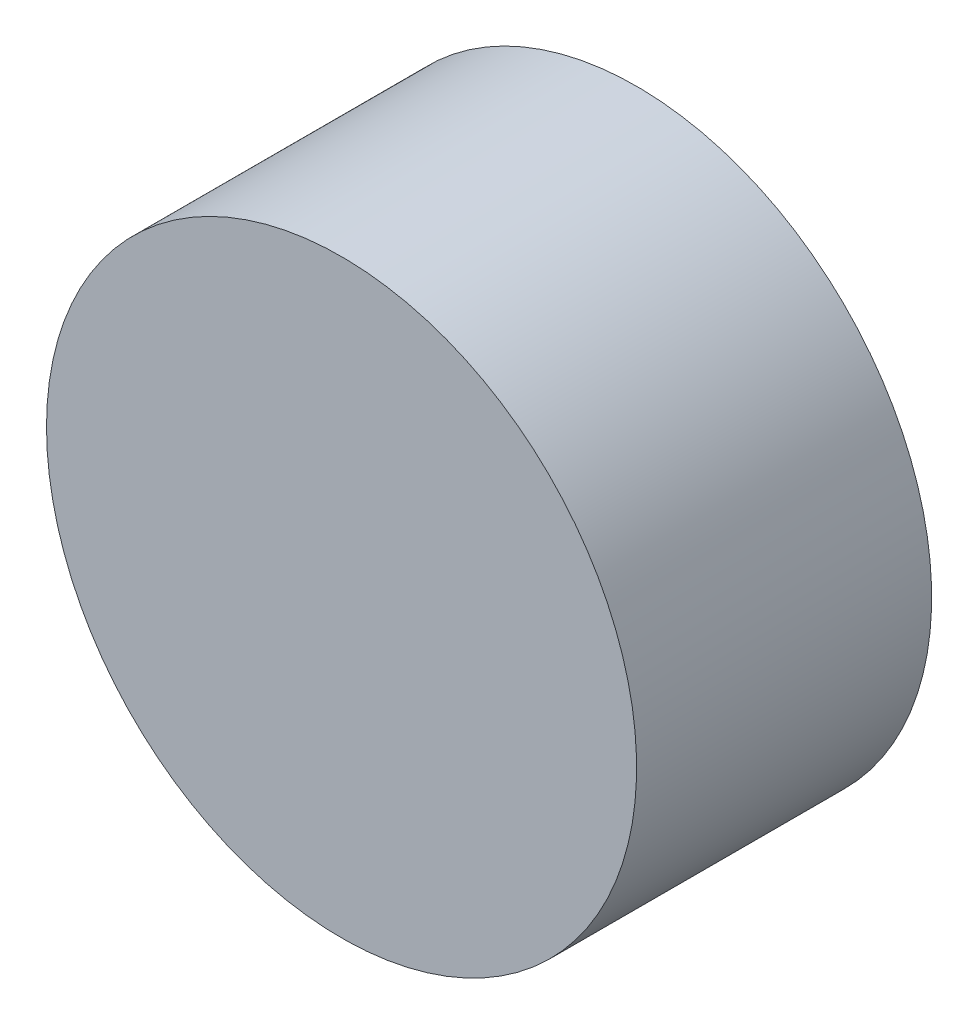
ISO-10303-21;
HEADER;
FILE_DESCRIPTION(('STEP AP214'),'2;1');
FILE_NAME('part.step','',(''),(''),'','','');
FILE_SCHEMA(('AUTOMOTIVE_DESIGN { 1 0 10303 214 1 1 1 1 }'));
ENDSEC;
DATA;
#1=APPLICATION_CONTEXT('core data for automotive mechanical design processes');
#2=APPLICATION_PROTOCOL_DEFINITION('international standard','automotive_design',2000,#1);
#3=PRODUCT_CONTEXT('',#1,'mechanical');
#4=PRODUCT('Part','Part','',(#3));
#5=PRODUCT_RELATED_PRODUCT_CATEGORY('part','',(#4));
#6=PRODUCT_DEFINITION_FORMATION('','',#4);
#7=PRODUCT_DEFINITION_CONTEXT('part definition',#1,'design');
#8=PRODUCT_DEFINITION('design','',#6,#7);
#9=PRODUCT_DEFINITION_SHAPE('','',#8);
#10=(LENGTH_UNIT() NAMED_UNIT(*) SI_UNIT(.MILLI.,.METRE.));
#11=(NAMED_UNIT(*) PLANE_ANGLE_UNIT() SI_UNIT($,.RADIAN.));
#12=(NAMED_UNIT(*) SI_UNIT($,.STERADIAN.) SOLID_ANGLE_UNIT());
#13=UNCERTAINTY_MEASURE_WITH_UNIT(LENGTH_MEASURE(1.E-05),#10,'distance_accuracy_value','');
#14=(GEOMETRIC_REPRESENTATION_CONTEXT(3) GLOBAL_UNCERTAINTY_ASSIGNED_CONTEXT((#13)) GLOBAL_UNIT_ASSIGNED_CONTEXT((#10,
#11,#12)) REPRESENTATION_CONTEXT('',''));
#15=CARTESIAN_POINT('',(0.,0.,0.));
#16=DIRECTION('',(0.,0.,1.));
#17=DIRECTION('',(1.,0.,0.));
#18=AXIS2_PLACEMENT_3D('',#15,#16,#17);
#19=CARTESIAN_POINT('',(0.,0.,25.4));
#20=DIRECTION('',(0.,0.,1.));
#21=DIRECTION('',(1.,0.,0.));
#22=AXIS2_PLACEMENT_3D('',#19,#20,#21);
#23=PLANE('',#22);
#24=CARTESIAN_POINT('',(0.,0.,25.4));
#25=DIRECTION('',(0.,0.,-1.));
#26=DIRECTION('',(-1.,0.,0.));
#27=AXIS2_PLACEMENT_3D('',#24,#25,#26);
#28=CIRCLE('',#27,25.4);
#29=CARTESIAN_POINT('',(-25.4,0.,25.4));
#30=VERTEX_POINT('',#29);
#31=EDGE_CURVE('E49',#30,#30,#28,.T.);
#32=ORIENTED_EDGE('',*,*,#31,.T.);
#33=EDGE_LOOP('',(#32));
#34=FACE_BOUND('',#33,.T.);
#35=ADVANCED_FACE('F35',(#34),#23,.F.);
#36=CARTESIAN_POINT('',(-28.575,0.,28.575));
#37=DIRECTION('',(0.,0.,-1.));
#38=DIRECTION('',(-1.,0.,0.));
#39=AXIS2_PLACEMENT_3D('',#36,#37,#38);
#40=PLANE('',#39);
#41=CARTESIAN_POINT('',(0.,0.,28.575));
#42=DIRECTION('',(0.,0.,-1.));
#43=DIRECTION('',(-1.,0.,0.));
#44=AXIS2_PLACEMENT_3D('',#41,#42,#43);
#45=CIRCLE('',#44,28.575);
#46=CARTESIAN_POINT('',(-28.575,0.,28.575));
#47=VERTEX_POINT('',#46);
#48=EDGE_CURVE('E10',#47,#47,#45,.T.);
#49=ORIENTED_EDGE('',*,*,#48,.F.);
#50=EDGE_LOOP('',(#49));
#51=FACE_BOUND('',#50,.T.);
#52=ADVANCED_FACE('F69',(#51),#40,.F.);
#53=CARTESIAN_POINT('',(0.,0.,0.));
#54=DIRECTION('',(0.,0.,-1.));
#55=DIRECTION('',(-1.,0.,0.));
#56=AXIS2_PLACEMENT_3D('',#53,#54,#55);
#57=CYLINDRICAL_SURFACE('',#56,28.575);
#58=CARTESIAN_POINT('',(0.,0.,0.));
#59=DIRECTION('',(0.,0.,-1.));
#60=DIRECTION('',(-1.,0.,0.));
#61=AXIS2_PLACEMENT_3D('',#58,#59,#60);
#62=CIRCLE('',#61,28.575);
#63=CARTESIAN_POINT('',(-28.575,0.,0.));
#64=VERTEX_POINT('',#63);
#65=EDGE_CURVE('E41',#64,#64,#62,.T.);
#66=ORIENTED_EDGE('',*,*,#65,.F.);
#67=EDGE_LOOP('',(#66));
#68=FACE_BOUND('',#67,.T.);
#69=ORIENTED_EDGE('',*,*,#48,.T.);
#70=EDGE_LOOP('',(#69));
#71=FACE_BOUND('',#70,.T.);
#72=ADVANCED_FACE('F64',(#68,#71),#57,.T.);
#73=CARTESIAN_POINT('',(-28.575,0.,0.));
#74=DIRECTION('',(0.,0.,1.));
#75=DIRECTION('',(1.,0.,0.));
#76=AXIS2_PLACEMENT_3D('',#73,#74,#75);
#77=PLANE('',#76);
#78=CARTESIAN_POINT('',(0.,0.,0.));
#79=DIRECTION('',(0.,0.,-1.));
#80=DIRECTION('',(-1.,0.,0.));
#81=AXIS2_PLACEMENT_3D('',#78,#79,#80);
#82=CIRCLE('',#81,25.4);
#83=CARTESIAN_POINT('',(-25.4,0.,0.));
#84=VERTEX_POINT('',#83);
#85=EDGE_CURVE('E45',#84,#84,#82,.T.);
#86=ORIENTED_EDGE('',*,*,#85,.F.);
#87=EDGE_LOOP('',(#86));
#88=FACE_BOUND('',#87,.T.);
#89=ORIENTED_EDGE('',*,*,#65,.T.);
#90=EDGE_LOOP('',(#89));
#91=FACE_BOUND('',#90,.T.);
#92=ADVANCED_FACE('F59',(#88,#91),#77,.F.);
#93=CARTESIAN_POINT('',(0.,0.,0.));
#94=DIRECTION('',(0.,0.,-1.));
#95=DIRECTION('',(-1.,0.,0.));
#96=AXIS2_PLACEMENT_3D('',#93,#94,#95);
#97=CYLINDRICAL_SURFACE('',#96,25.4);
#98=ORIENTED_EDGE('',*,*,#31,.F.);
#99=EDGE_LOOP('',(#98));
#100=FACE_BOUND('',#99,.T.);
#101=ORIENTED_EDGE('',*,*,#85,.T.);
#102=EDGE_LOOP('',(#101));
#103=FACE_BOUND('',#102,.T.);
#104=ADVANCED_FACE('F56',(#100,#103),#97,.F.);
#105=CLOSED_SHELL('',(#35,#52,#72,#92,#104));
#106=MANIFOLD_SOLID_BREP('B2',#105);
#107=ADVANCED_BREP_SHAPE_REPRESENTATION('',(#18,#106),#14);
#108=SHAPE_DEFINITION_REPRESENTATION(#9,#107);
ENDSEC;
END-ISO-10303-21;
